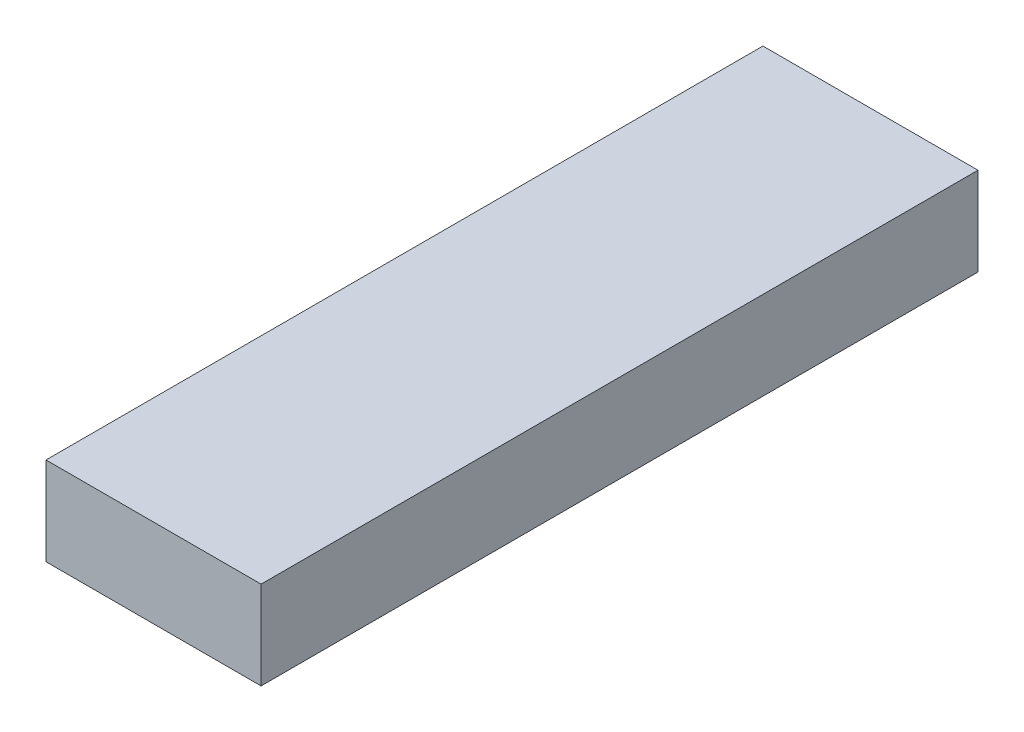
ISO-10303-21;
HEADER;
FILE_DESCRIPTION(('STEP AP214'),'2;1');
FILE_NAME('part.step','',(''),(''),'','','');
FILE_SCHEMA(('AUTOMOTIVE_DESIGN { 1 0 10303 214 1 1 1 1 }'));
ENDSEC;
DATA;
#1=APPLICATION_CONTEXT('core data for automotive mechanical design processes');
#2=APPLICATION_PROTOCOL_DEFINITION('international standard','automotive_design',2000,#1);
#3=PRODUCT_CONTEXT('',#1,'mechanical');
#4=PRODUCT('Part','Part','',(#3));
#5=PRODUCT_RELATED_PRODUCT_CATEGORY('part','',(#4));
#6=PRODUCT_DEFINITION_FORMATION('','',#4);
#7=PRODUCT_DEFINITION_CONTEXT('part definition',#1,'design');
#8=PRODUCT_DEFINITION('design','',#6,#7);
#9=PRODUCT_DEFINITION_SHAPE('','',#8);
#10=(LENGTH_UNIT() NAMED_UNIT(*) SI_UNIT(.MILLI.,.METRE.));
#11=(NAMED_UNIT(*) PLANE_ANGLE_UNIT() SI_UNIT($,.RADIAN.));
#12=(NAMED_UNIT(*) SI_UNIT($,.STERADIAN.) SOLID_ANGLE_UNIT());
#13=UNCERTAINTY_MEASURE_WITH_UNIT(LENGTH_MEASURE(1.E-05),#10,'distance_accuracy_value','');
#14=(GEOMETRIC_REPRESENTATION_CONTEXT(3) GLOBAL_UNCERTAINTY_ASSIGNED_CONTEXT((#13)) GLOBAL_UNIT_ASSIGNED_CONTEXT((#10,
#11,#12)) REPRESENTATION_CONTEXT('',''));
#15=CARTESIAN_POINT('',(0.,0.,0.));
#16=DIRECTION('',(0.,0.,1.));
#17=DIRECTION('',(1.,0.,0.));
#18=AXIS2_PLACEMENT_3D('',#15,#16,#17);
#19=CARTESIAN_POINT('',(1.5,-6.23,70.));
#20=DIRECTION('',(-1.,0.,0.));
#21=DIRECTION('',(0.,0.,-1.));
#22=AXIS2_PLACEMENT_3D('',#19,#20,#21);
#23=PLANE('',#22);
#24=DIRECTION('',(0.,0.,1.));
#25=VECTOR('',#24,1.);
#26=CARTESIAN_POINT('',(1.5,-5.,70.));
#27=LINE('',#26,#25);
#28=CARTESIAN_POINT('',(1.5,-5.,60.));
#29=VERTEX_POINT('',#28);
#30=CARTESIAN_POINT('',(1.5,-5.,70.));
#31=VERTEX_POINT('',#30);
#32=EDGE_CURVE('E11',#29,#31,#27,.T.);
#33=ORIENTED_EDGE('',*,*,#32,.T.);
#34=DIRECTION('',(0.,1.,0.));
#35=VECTOR('',#34,1.);
#36=CARTESIAN_POINT('',(1.5,-6.23,70.));
#37=LINE('',#36,#35);
#38=CARTESIAN_POINT('',(1.5,-6.23,70.));
#39=VERTEX_POINT('',#38);
#40=EDGE_CURVE('E25',#39,#31,#37,.T.);
#41=ORIENTED_EDGE('',*,*,#40,.F.);
#42=DIRECTION('',(0.,0.,1.));
#43=VECTOR('',#42,1.);
#44=CARTESIAN_POINT('',(1.5,-6.23,70.));
#45=LINE('',#44,#43);
#46=CARTESIAN_POINT('',(1.5,-6.23,60.));
#47=VERTEX_POINT('',#46);
#48=EDGE_CURVE('E109',#47,#39,#45,.T.);
#49=ORIENTED_EDGE('',*,*,#48,.F.);
#50=DIRECTION('',(0.,1.,0.));
#51=VECTOR('',#50,1.);
#52=CARTESIAN_POINT('',(1.5,-6.23,60.));
#53=LINE('',#52,#51);
#54=EDGE_CURVE('E83',#47,#29,#53,.T.);
#55=ORIENTED_EDGE('',*,*,#54,.T.);
#56=EDGE_LOOP('',(#33,#41,#49,#55));
#57=FACE_BOUND('',#56,.T.);
#58=ADVANCED_FACE('F17',(#57),#23,.F.);
#59=CARTESIAN_POINT('',(1.5,-6.23,70.));
#60=DIRECTION('',(0.,0.,-1.));
#61=DIRECTION('',(0.,1.,0.));
#62=AXIS2_PLACEMENT_3D('',#59,#60,#61);
#63=PLANE('',#62);
#64=DIRECTION('',(-1.,0.,0.));
#65=VECTOR('',#64,1.);
#66=CARTESIAN_POINT('',(1.5,-5.,70.));
#67=LINE('',#66,#65);
#68=CARTESIAN_POINT('',(-1.5,-5.,70.));
#69=VERTEX_POINT('',#68);
#70=EDGE_CURVE('E104',#31,#69,#67,.T.);
#71=ORIENTED_EDGE('',*,*,#70,.T.);
#72=DIRECTION('',(0.,1.,0.));
#73=VECTOR('',#72,1.);
#74=CARTESIAN_POINT('',(-1.5,-6.23,70.));
#75=LINE('',#74,#73);
#76=CARTESIAN_POINT('',(-1.5,-6.23,70.));
#77=VERTEX_POINT('',#76);
#78=EDGE_CURVE('E101',#77,#69,#75,.T.);
#79=ORIENTED_EDGE('',*,*,#78,.F.);
#80=DIRECTION('',(-1.,0.,0.));
#81=VECTOR('',#80,1.);
#82=CARTESIAN_POINT('',(1.5,-6.23,70.));
#83=LINE('',#82,#81);
#84=EDGE_CURVE('E90',#39,#77,#83,.T.);
#85=ORIENTED_EDGE('',*,*,#84,.F.);
#86=ORIENTED_EDGE('',*,*,#40,.T.);
#87=EDGE_LOOP('',(#71,#79,#85,#86));
#88=FACE_BOUND('',#87,.T.);
#89=ADVANCED_FACE('F115',(#88),#63,.F.);
#90=CARTESIAN_POINT('',(-1.5,-6.23,60.));
#91=DIRECTION('',(1.,0.,0.));
#92=DIRECTION('',(0.,0.,1.));
#93=AXIS2_PLACEMENT_3D('',#90,#91,#92);
#94=PLANE('',#93);
#95=DIRECTION('',(0.,0.,-1.));
#96=VECTOR('',#95,1.);
#97=CARTESIAN_POINT('',(-1.5,-5.,60.));
#98=LINE('',#97,#96);
#99=CARTESIAN_POINT('',(-1.5,-5.,60.));
#100=VERTEX_POINT('',#99);
#101=EDGE_CURVE('E73',#69,#100,#98,.T.);
#102=ORIENTED_EDGE('',*,*,#101,.T.);
#103=DIRECTION('',(0.,1.,0.));
#104=VECTOR('',#103,1.);
#105=CARTESIAN_POINT('',(-1.5,-6.23,60.));
#106=LINE('',#105,#104);
#107=CARTESIAN_POINT('',(-1.5,-6.23,60.));
#108=VERTEX_POINT('',#107);
#109=EDGE_CURVE('E65',#108,#100,#106,.T.);
#110=ORIENTED_EDGE('',*,*,#109,.F.);
#111=DIRECTION('',(0.,0.,-1.));
#112=VECTOR('',#111,1.);
#113=CARTESIAN_POINT('',(-1.5,-6.23,60.));
#114=LINE('',#113,#112);
#115=EDGE_CURVE('E70',#77,#108,#114,.T.);
#116=ORIENTED_EDGE('',*,*,#115,.F.);
#117=ORIENTED_EDGE('',*,*,#78,.T.);
#118=EDGE_LOOP('',(#102,#110,#116,#117));
#119=FACE_BOUND('',#118,.T.);
#120=ADVANCED_FACE('F67',(#119),#94,.F.);
#121=CARTESIAN_POINT('',(1.5,-6.23,60.));
#122=DIRECTION('',(0.,0.,1.));
#123=DIRECTION('',(0.,-1.,0.));
#124=AXIS2_PLACEMENT_3D('',#121,#122,#123);
#125=PLANE('',#124);
#126=DIRECTION('',(1.,0.,0.));
#127=VECTOR('',#126,1.);
#128=CARTESIAN_POINT('',(1.5,-5.,60.));
#129=LINE('',#128,#127);
#130=EDGE_CURVE('E87',#100,#29,#129,.T.);
#131=ORIENTED_EDGE('',*,*,#130,.T.);
#132=ORIENTED_EDGE('',*,*,#54,.F.);
#133=DIRECTION('',(1.,0.,0.));
#134=VECTOR('',#133,1.);
#135=CARTESIAN_POINT('',(1.5,-6.23,60.));
#136=LINE('',#135,#134);
#137=EDGE_CURVE('E81',#108,#47,#136,.T.);
#138=ORIENTED_EDGE('',*,*,#137,.F.);
#139=ORIENTED_EDGE('',*,*,#109,.T.);
#140=EDGE_LOOP('',(#131,#132,#138,#139));
#141=FACE_BOUND('',#140,.T.);
#142=ADVANCED_FACE('F82',(#141),#125,.F.);
#143=CARTESIAN_POINT('',(0.,-6.23,0.));
#144=DIRECTION('',(0.,1.,0.));
#145=DIRECTION('',(-1.,0.,0.));
#146=AXIS2_PLACEMENT_3D('',#143,#144,#145);
#147=PLANE('',#146);
#148=ORIENTED_EDGE('',*,*,#48,.T.);
#149=ORIENTED_EDGE('',*,*,#84,.T.);
#150=ORIENTED_EDGE('',*,*,#115,.T.);
#151=ORIENTED_EDGE('',*,*,#137,.T.);
#152=EDGE_LOOP('',(#148,#149,#150,#151));
#153=FACE_BOUND('',#152,.T.);
#154=ADVANCED_FACE('F89',(#153),#147,.F.);
#155=CARTESIAN_POINT('',(0.,-5.,0.));
#156=DIRECTION('',(0.,1.,0.));
#157=DIRECTION('',(-1.,0.,0.));
#158=AXIS2_PLACEMENT_3D('',#155,#156,#157);
#159=PLANE('',#158);
#160=ORIENTED_EDGE('',*,*,#32,.F.);
#161=ORIENTED_EDGE('',*,*,#130,.F.);
#162=ORIENTED_EDGE('',*,*,#101,.F.);
#163=ORIENTED_EDGE('',*,*,#70,.F.);
#164=EDGE_LOOP('',(#160,#161,#162,#163));
#165=FACE_BOUND('',#164,.T.);
#166=ADVANCED_FACE('F117',(#165),#159,.T.);
#167=CLOSED_SHELL('',(#58,#89,#120,#142,#154,#166));
#168=MANIFOLD_SOLID_BREP('B1',#167);
#169=ADVANCED_BREP_SHAPE_REPRESENTATION('',(#18,#168),#14);
#170=SHAPE_DEFINITION_REPRESENTATION(#9,#169);
ENDSEC;
END-ISO-10303-21;
